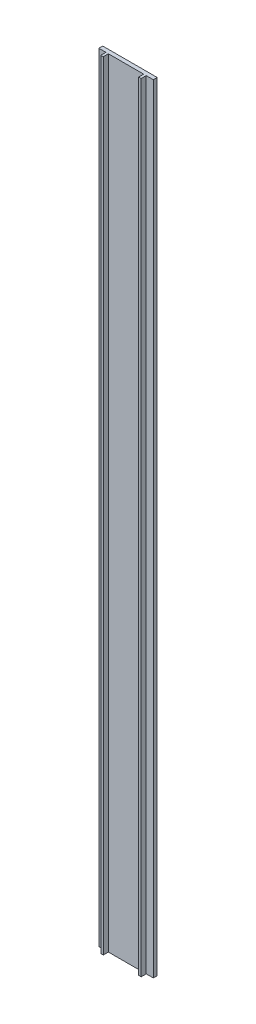
ISO-10303-21;
HEADER;
FILE_DESCRIPTION(('STEP AP214'),'2;1');
FILE_NAME('part.step','',(''),(''),'','','');
FILE_SCHEMA(('AUTOMOTIVE_DESIGN { 1 0 10303 214 1 1 1 1 }'));
ENDSEC;
DATA;
#1=APPLICATION_CONTEXT('core data for automotive mechanical design processes');
#2=APPLICATION_PROTOCOL_DEFINITION('international standard','automotive_design',2000,#1);
#3=PRODUCT_CONTEXT('',#1,'mechanical');
#4=PRODUCT('Part','Part','',(#3));
#5=PRODUCT_RELATED_PRODUCT_CATEGORY('part','',(#4));
#6=PRODUCT_DEFINITION_FORMATION('','',#4);
#7=PRODUCT_DEFINITION_CONTEXT('part definition',#1,'design');
#8=PRODUCT_DEFINITION('design','',#6,#7);
#9=PRODUCT_DEFINITION_SHAPE('','',#8);
#10=(LENGTH_UNIT() NAMED_UNIT(*) SI_UNIT(.MILLI.,.METRE.));
#11=(NAMED_UNIT(*) PLANE_ANGLE_UNIT() SI_UNIT($,.RADIAN.));
#12=(NAMED_UNIT(*) SI_UNIT($,.STERADIAN.) SOLID_ANGLE_UNIT());
#13=UNCERTAINTY_MEASURE_WITH_UNIT(LENGTH_MEASURE(1.E-05),#10,'distance_accuracy_value','');
#14=(GEOMETRIC_REPRESENTATION_CONTEXT(3) GLOBAL_UNCERTAINTY_ASSIGNED_CONTEXT((#13)) GLOBAL_UNIT_ASSIGNED_CONTEXT((#10,
#11,#12)) REPRESENTATION_CONTEXT('',''));
#15=CARTESIAN_POINT('',(0.,0.,0.));
#16=DIRECTION('',(0.,0.,1.));
#17=DIRECTION('',(1.,0.,0.));
#18=AXIS2_PLACEMENT_3D('',#15,#16,#17);
#19=CARTESIAN_POINT('',(0.,0.,5.));
#20=DIRECTION('',(0.,0.,-1.));
#21=DIRECTION('',(-1.,0.,0.));
#22=AXIS2_PLACEMENT_3D('',#19,#20,#21);
#23=PLANE('',#22);
#24=DIRECTION('',(0.,1.,0.));
#25=VECTOR('',#24,1.);
#26=CARTESIAN_POINT('',(25.905,500.,5.));
#27=LINE('',#26,#25);
#28=CARTESIAN_POINT('',(25.9050000000001,-500.,5.));
#29=VERTEX_POINT('',#28);
#30=CARTESIAN_POINT('',(25.9050000000001,500.,5.));
#31=VERTEX_POINT('',#30);
#32=EDGE_CURVE('E158',#29,#31,#27,.T.);
#33=ORIENTED_EDGE('',*,*,#32,.F.);
#34=DIRECTION('',(1.,0.,0.));
#35=VECTOR('',#34,1.);
#36=CARTESIAN_POINT('',(-35.,-500.,5.));
#37=LINE('',#36,#35);
#38=CARTESIAN_POINT('',(35.0000000000001,-500.,5.));
#39=VERTEX_POINT('',#38);
#40=EDGE_CURVE('E208',#29,#39,#37,.T.);
#41=ORIENTED_EDGE('',*,*,#40,.T.);
#42=DIRECTION('',(0.,1.,0.));
#43=VECTOR('',#42,1.);
#44=CARTESIAN_POINT('',(35.0000000000001,-500.,5.));
#45=LINE('',#44,#43);
#46=CARTESIAN_POINT('',(35.0000000000001,500.,5.));
#47=VERTEX_POINT('',#46);
#48=EDGE_CURVE('E199',#39,#47,#45,.T.);
#49=ORIENTED_EDGE('',*,*,#48,.T.);
#50=DIRECTION('',(-1.,0.,0.));
#51=VECTOR('',#50,1.);
#52=CARTESIAN_POINT('',(-35.,500.,5.));
#53=LINE('',#52,#51);
#54=EDGE_CURVE('E64',#47,#31,#53,.T.);
#55=ORIENTED_EDGE('',*,*,#54,.T.);
#56=EDGE_LOOP('',(#33,#41,#49,#55));
#57=FACE_BOUND('',#56,.T.);
#58=ADVANCED_FACE('F41',(#57),#23,.F.);
#59=DIRECTION('',(0.,-1.,0.));
#60=VECTOR('',#59,1.);
#61=CARTESIAN_POINT('',(22.695,500.,5.));
#62=LINE('',#61,#60);
#63=CARTESIAN_POINT('',(22.695,500.,5.));
#64=VERTEX_POINT('',#63);
#65=CARTESIAN_POINT('',(22.695,-500.,5.));
#66=VERTEX_POINT('',#65);
#67=EDGE_CURVE('E56',#64,#66,#62,.T.);
#68=ORIENTED_EDGE('',*,*,#67,.F.);
#69=CARTESIAN_POINT('',(-22.695,500.,5.));
#70=VERTEX_POINT('',#69);
#71=EDGE_CURVE('E206',#64,#70,#53,.T.);
#72=ORIENTED_EDGE('',*,*,#71,.T.);
#73=DIRECTION('',(0.,1.,0.));
#74=VECTOR('',#73,1.);
#75=CARTESIAN_POINT('',(-22.695,-500.,5.));
#76=LINE('',#75,#74);
#77=CARTESIAN_POINT('',(-22.695,-500.,5.));
#78=VERTEX_POINT('',#77);
#79=EDGE_CURVE('E159',#78,#70,#76,.T.);
#80=ORIENTED_EDGE('',*,*,#79,.F.);
#81=EDGE_CURVE('E213',#78,#66,#37,.T.);
#82=ORIENTED_EDGE('',*,*,#81,.T.);
#83=EDGE_LOOP('',(#68,#72,#80,#82));
#84=FACE_BOUND('',#83,.T.);
#85=ADVANCED_FACE('F250',(#84),#23,.F.);
#86=DIRECTION('',(0.,-1.,0.));
#87=VECTOR('',#86,1.);
#88=CARTESIAN_POINT('',(-25.905,-500.,5.));
#89=LINE('',#88,#87);
#90=CARTESIAN_POINT('',(-25.905,500.,5.));
#91=VERTEX_POINT('',#90);
#92=CARTESIAN_POINT('',(-25.905,-500.,5.));
#93=VERTEX_POINT('',#92);
#94=EDGE_CURVE('E163',#91,#93,#89,.T.);
#95=ORIENTED_EDGE('',*,*,#94,.F.);
#96=CARTESIAN_POINT('',(-35.,500.,5.));
#97=VERTEX_POINT('',#96);
#98=EDGE_CURVE('E202',#91,#97,#53,.T.);
#99=ORIENTED_EDGE('',*,*,#98,.T.);
#100=DIRECTION('',(0.,-1.,0.));
#101=VECTOR('',#100,1.);
#102=CARTESIAN_POINT('',(-35.,-500.,5.));
#103=LINE('',#102,#101);
#104=CARTESIAN_POINT('',(-35.,-500.,5.));
#105=VERTEX_POINT('',#104);
#106=EDGE_CURVE('E205',#97,#105,#103,.T.);
#107=ORIENTED_EDGE('',*,*,#106,.T.);
#108=EDGE_CURVE('E209',#105,#93,#37,.T.);
#109=ORIENTED_EDGE('',*,*,#108,.T.);
#110=EDGE_LOOP('',(#95,#99,#107,#109));
#111=FACE_BOUND('',#110,.T.);
#112=ADVANCED_FACE('F276',(#111),#23,.F.);
#113=CARTESIAN_POINT('',(35.0000000000001,-500.,5.));
#114=DIRECTION('',(-1.,0.,0.));
#115=DIRECTION('',(0.,0.,1.));
#116=AXIS2_PLACEMENT_3D('',#113,#114,#115);
#117=PLANE('',#116);
#118=DIRECTION('',(0.,1.,0.));
#119=VECTOR('',#118,1.);
#120=CARTESIAN_POINT('',(35.0000000000001,-500.,0.));
#121=LINE('',#120,#119);
#122=CARTESIAN_POINT('',(35.0000000000001,-500.,0.));
#123=VERTEX_POINT('',#122);
#124=CARTESIAN_POINT('',(35.0000000000001,500.,0.));
#125=VERTEX_POINT('',#124);
#126=EDGE_CURVE('E198',#123,#125,#121,.T.);
#127=ORIENTED_EDGE('',*,*,#126,.T.);
#128=DIRECTION('',(0.,0.,-1.));
#129=VECTOR('',#128,1.);
#130=CARTESIAN_POINT('',(35.0000000000001,500.,5.));
#131=LINE('',#130,#129);
#132=EDGE_CURVE('E11',#47,#125,#131,.T.);
#133=ORIENTED_EDGE('',*,*,#132,.F.);
#134=ORIENTED_EDGE('',*,*,#48,.F.);
#135=DIRECTION('',(0.,0.,-1.));
#136=VECTOR('',#135,1.);
#137=CARTESIAN_POINT('',(35.0000000000001,-500.,5.));
#138=LINE('',#137,#136);
#139=EDGE_CURVE('E212',#39,#123,#138,.T.);
#140=ORIENTED_EDGE('',*,*,#139,.T.);
#141=EDGE_LOOP('',(#127,#133,#134,#140));
#142=FACE_BOUND('',#141,.T.);
#143=ADVANCED_FACE('F43',(#142),#117,.F.);
#144=CARTESIAN_POINT('',(-35.,500.,5.));
#145=DIRECTION('',(0.,-1.,0.));
#146=DIRECTION('',(0.,0.,-1.));
#147=AXIS2_PLACEMENT_3D('',#144,#145,#146);
#148=PLANE('',#147);
#149=DIRECTION('',(-1.,0.,0.));
#150=VECTOR('',#149,1.);
#151=CARTESIAN_POINT('',(-35.,500.,0.));
#152=LINE('',#151,#150);
#153=CARTESIAN_POINT('',(-35.,500.,0.));
#154=VERTEX_POINT('',#153);
#155=EDGE_CURVE('E217',#125,#154,#152,.T.);
#156=ORIENTED_EDGE('',*,*,#155,.T.);
#157=DIRECTION('',(0.,0.,-1.));
#158=VECTOR('',#157,1.);
#159=CARTESIAN_POINT('',(-35.,500.,5.));
#160=LINE('',#159,#158);
#161=EDGE_CURVE('E49',#97,#154,#160,.T.);
#162=ORIENTED_EDGE('',*,*,#161,.F.);
#163=ORIENTED_EDGE('',*,*,#98,.F.);
#164=DIRECTION('',(0.,0.,-1.));
#165=VECTOR('',#164,1.);
#166=CARTESIAN_POINT('',(-25.905,500.,11.5));
#167=LINE('',#166,#165);
#168=CARTESIAN_POINT('',(-25.905,500.,11.5));
#169=VERTEX_POINT('',#168);
#170=EDGE_CURVE('E192',#169,#91,#167,.T.);
#171=ORIENTED_EDGE('',*,*,#170,.F.);
#172=DIRECTION('',(-1.,0.,0.));
#173=VECTOR('',#172,1.);
#174=CARTESIAN_POINT('',(-22.695,500.,11.5));
#175=LINE('',#174,#173);
#176=CARTESIAN_POINT('',(-22.695,500.,11.5));
#177=VERTEX_POINT('',#176);
#178=EDGE_CURVE('E173',#177,#169,#175,.T.);
#179=ORIENTED_EDGE('',*,*,#178,.F.);
#180=DIRECTION('',(0.,0.,-1.));
#181=VECTOR('',#180,1.);
#182=CARTESIAN_POINT('',(-22.695,500.,11.5));
#183=LINE('',#182,#181);
#184=EDGE_CURVE('E195',#177,#70,#183,.T.);
#185=ORIENTED_EDGE('',*,*,#184,.T.);
#186=ORIENTED_EDGE('',*,*,#71,.F.);
#187=DIRECTION('',(0.,0.,-1.));
#188=VECTOR('',#187,1.);
#189=CARTESIAN_POINT('',(22.695,500.,11.5));
#190=LINE('',#189,#188);
#191=CARTESIAN_POINT('',(22.695,500.,11.5));
#192=VERTEX_POINT('',#191);
#193=EDGE_CURVE('E142',#192,#64,#190,.T.);
#194=ORIENTED_EDGE('',*,*,#193,.F.);
#195=DIRECTION('',(-1.,0.,0.));
#196=VECTOR('',#195,1.);
#197=CARTESIAN_POINT('',(25.905,500.,11.5));
#198=LINE('',#197,#196);
#199=CARTESIAN_POINT('',(25.905,500.,11.5));
#200=VERTEX_POINT('',#199);
#201=EDGE_CURVE('E135',#200,#192,#198,.T.);
#202=ORIENTED_EDGE('',*,*,#201,.F.);
#203=DIRECTION('',(0.,0.,-1.));
#204=VECTOR('',#203,1.);
#205=CARTESIAN_POINT('',(25.905,500.,11.5));
#206=LINE('',#205,#204);
#207=EDGE_CURVE('E139',#200,#31,#206,.T.);
#208=ORIENTED_EDGE('',*,*,#207,.T.);
#209=ORIENTED_EDGE('',*,*,#54,.F.);
#210=ORIENTED_EDGE('',*,*,#132,.T.);
#211=EDGE_LOOP('',(#156,#162,#163,#171,#179,#185,#186,#194,#202,#208,#209,#210));
#212=FACE_BOUND('',#211,.T.);
#213=ADVANCED_FACE('F137',(#212),#148,.F.);
#214=CARTESIAN_POINT('',(-35.,-500.,5.));
#215=DIRECTION('',(1.,0.,0.));
#216=DIRECTION('',(0.,0.,-1.));
#217=AXIS2_PLACEMENT_3D('',#214,#215,#216);
#218=PLANE('',#217);
#219=DIRECTION('',(0.,-1.,0.));
#220=VECTOR('',#219,1.);
#221=CARTESIAN_POINT('',(-35.,-500.,0.));
#222=LINE('',#221,#220);
#223=CARTESIAN_POINT('',(-35.,-500.,0.));
#224=VERTEX_POINT('',#223);
#225=EDGE_CURVE('E219',#154,#224,#222,.T.);
#226=ORIENTED_EDGE('',*,*,#225,.T.);
#227=DIRECTION('',(0.,0.,-1.));
#228=VECTOR('',#227,1.);
#229=CARTESIAN_POINT('',(-35.,-500.,5.));
#230=LINE('',#229,#228);
#231=EDGE_CURVE('E226',#105,#224,#230,.T.);
#232=ORIENTED_EDGE('',*,*,#231,.F.);
#233=ORIENTED_EDGE('',*,*,#106,.F.);
#234=ORIENTED_EDGE('',*,*,#161,.T.);
#235=EDGE_LOOP('',(#226,#232,#233,#234));
#236=FACE_BOUND('',#235,.T.);
#237=ADVANCED_FACE('F233',(#236),#218,.F.);
#238=CARTESIAN_POINT('',(-35.,-500.,5.));
#239=DIRECTION('',(0.,1.,0.));
#240=DIRECTION('',(0.,0.,1.));
#241=AXIS2_PLACEMENT_3D('',#238,#239,#240);
#242=PLANE('',#241);
#243=DIRECTION('',(1.,0.,0.));
#244=VECTOR('',#243,1.);
#245=CARTESIAN_POINT('',(-35.,-500.,0.));
#246=LINE('',#245,#244);
#247=EDGE_CURVE('E203',#224,#123,#246,.T.);
#248=ORIENTED_EDGE('',*,*,#247,.T.);
#249=ORIENTED_EDGE('',*,*,#139,.F.);
#250=ORIENTED_EDGE('',*,*,#40,.F.);
#251=DIRECTION('',(0.,0.,-1.));
#252=VECTOR('',#251,1.);
#253=CARTESIAN_POINT('',(25.9050000000001,-500.,11.5));
#254=LINE('',#253,#252);
#255=CARTESIAN_POINT('',(25.9050000000001,-500.,11.5));
#256=VERTEX_POINT('',#255);
#257=EDGE_CURVE('E258',#256,#29,#254,.T.);
#258=ORIENTED_EDGE('',*,*,#257,.F.);
#259=DIRECTION('',(1.,0.,0.));
#260=VECTOR('',#259,1.);
#261=CARTESIAN_POINT('',(25.9050000000001,-500.,11.5));
#262=LINE('',#261,#260);
#263=CARTESIAN_POINT('',(22.6950000000001,-500.,11.5));
#264=VERTEX_POINT('',#263);
#265=EDGE_CURVE('E151',#264,#256,#262,.T.);
#266=ORIENTED_EDGE('',*,*,#265,.F.);
#267=DIRECTION('',(0.,0.,-1.));
#268=VECTOR('',#267,1.);
#269=CARTESIAN_POINT('',(22.6950000000001,-500.,11.5));
#270=LINE('',#269,#268);
#271=EDGE_CURVE('E165',#264,#66,#270,.T.);
#272=ORIENTED_EDGE('',*,*,#271,.T.);
#273=ORIENTED_EDGE('',*,*,#81,.F.);
#274=DIRECTION('',(0.,0.,-1.));
#275=VECTOR('',#274,1.);
#276=CARTESIAN_POINT('',(-22.695,-500.,11.5));
#277=LINE('',#276,#275);
#278=CARTESIAN_POINT('',(-22.695,-500.,11.5));
#279=VERTEX_POINT('',#278);
#280=EDGE_CURVE('E180',#279,#78,#277,.T.);
#281=ORIENTED_EDGE('',*,*,#280,.F.);
#282=DIRECTION('',(1.,0.,0.));
#283=VECTOR('',#282,1.);
#284=CARTESIAN_POINT('',(-22.695,-500.,11.5));
#285=LINE('',#284,#283);
#286=CARTESIAN_POINT('',(-25.905,-500.,11.5));
#287=VERTEX_POINT('',#286);
#288=EDGE_CURVE('E178',#287,#279,#285,.T.);
#289=ORIENTED_EDGE('',*,*,#288,.F.);
#290=DIRECTION('',(0.,0.,-1.));
#291=VECTOR('',#290,1.);
#292=CARTESIAN_POINT('',(-25.905,-500.,11.5));
#293=LINE('',#292,#291);
#294=EDGE_CURVE('E188',#287,#93,#293,.T.);
#295=ORIENTED_EDGE('',*,*,#294,.T.);
#296=ORIENTED_EDGE('',*,*,#108,.F.);
#297=ORIENTED_EDGE('',*,*,#231,.T.);
#298=EDGE_LOOP('',(#248,#249,#250,#258,#266,#272,#273,#281,#289,#295,#296,#297));
#299=FACE_BOUND('',#298,.T.);
#300=ADVANCED_FACE('F242',(#299),#242,.F.);
#301=CARTESIAN_POINT('',(0.,0.,0.));
#302=DIRECTION('',(0.,0.,-1.));
#303=DIRECTION('',(-1.,0.,0.));
#304=AXIS2_PLACEMENT_3D('',#301,#302,#303);
#305=PLANE('',#304);
#306=ORIENTED_EDGE('',*,*,#126,.F.);
#307=ORIENTED_EDGE('',*,*,#247,.F.);
#308=ORIENTED_EDGE('',*,*,#225,.F.);
#309=ORIENTED_EDGE('',*,*,#155,.F.);
#310=EDGE_LOOP('',(#306,#307,#308,#309));
#311=FACE_BOUND('',#310,.T.);
#312=ADVANCED_FACE('F239',(#311),#305,.T.);
#313=CARTESIAN_POINT('',(-22.695,-500.,11.5));
#314=DIRECTION('',(-1.,0.,0.));
#315=DIRECTION('',(0.,0.,1.));
#316=AXIS2_PLACEMENT_3D('',#313,#314,#315);
#317=PLANE('',#316);
#318=ORIENTED_EDGE('',*,*,#79,.T.);
#319=ORIENTED_EDGE('',*,*,#184,.F.);
#320=DIRECTION('',(0.,1.,0.));
#321=VECTOR('',#320,1.);
#322=CARTESIAN_POINT('',(-22.695,-500.,11.5));
#323=LINE('',#322,#321);
#324=EDGE_CURVE('E169',#279,#177,#323,.T.);
#325=ORIENTED_EDGE('',*,*,#324,.F.);
#326=ORIENTED_EDGE('',*,*,#280,.T.);
#327=EDGE_LOOP('',(#318,#319,#325,#326));
#328=FACE_BOUND('',#327,.T.);
#329=ADVANCED_FACE('F297',(#328),#317,.F.);
#330=CARTESIAN_POINT('',(-25.905,-500.,11.5));
#331=DIRECTION('',(1.,0.,0.));
#332=DIRECTION('',(0.,0.,-1.));
#333=AXIS2_PLACEMENT_3D('',#330,#331,#332);
#334=PLANE('',#333);
#335=ORIENTED_EDGE('',*,*,#94,.T.);
#336=ORIENTED_EDGE('',*,*,#294,.F.);
#337=DIRECTION('',(0.,-1.,0.));
#338=VECTOR('',#337,1.);
#339=CARTESIAN_POINT('',(-25.905,-500.,11.5));
#340=LINE('',#339,#338);
#341=EDGE_CURVE('E175',#169,#287,#340,.T.);
#342=ORIENTED_EDGE('',*,*,#341,.F.);
#343=ORIENTED_EDGE('',*,*,#170,.T.);
#344=EDGE_LOOP('',(#335,#336,#342,#343));
#345=FACE_BOUND('',#344,.T.);
#346=ADVANCED_FACE('F291',(#345),#334,.F.);
#347=CARTESIAN_POINT('',(0.,0.,11.5));
#348=DIRECTION('',(0.,0.,1.));
#349=DIRECTION('',(1.,0.,0.));
#350=AXIS2_PLACEMENT_3D('',#347,#348,#349);
#351=PLANE('',#350);
#352=ORIENTED_EDGE('',*,*,#324,.T.);
#353=ORIENTED_EDGE('',*,*,#178,.T.);
#354=ORIENTED_EDGE('',*,*,#341,.T.);
#355=ORIENTED_EDGE('',*,*,#288,.T.);
#356=EDGE_LOOP('',(#352,#353,#354,#355));
#357=FACE_BOUND('',#356,.T.);
#358=ADVANCED_FACE('F272',(#357),#351,.T.);
#359=CARTESIAN_POINT('',(25.905,500.,11.5));
#360=DIRECTION('',(-1.,0.,0.));
#361=DIRECTION('',(0.,-1.,0.));
#362=AXIS2_PLACEMENT_3D('',#359,#360,#361);
#363=PLANE('',#362);
#364=ORIENTED_EDGE('',*,*,#32,.T.);
#365=ORIENTED_EDGE('',*,*,#207,.F.);
#366=DIRECTION('',(0.,1.,0.));
#367=VECTOR('',#366,1.);
#368=CARTESIAN_POINT('',(25.905,500.,11.5));
#369=LINE('',#368,#367);
#370=EDGE_CURVE('E146',#256,#200,#369,.T.);
#371=ORIENTED_EDGE('',*,*,#370,.F.);
#372=ORIENTED_EDGE('',*,*,#257,.T.);
#373=EDGE_LOOP('',(#364,#365,#371,#372));
#374=FACE_BOUND('',#373,.T.);
#375=ADVANCED_FACE('F157',(#374),#363,.F.);
#376=CARTESIAN_POINT('',(22.695,500.,11.5));
#377=DIRECTION('',(1.,0.,0.));
#378=DIRECTION('',(0.,1.,0.));
#379=AXIS2_PLACEMENT_3D('',#376,#377,#378);
#380=PLANE('',#379);
#381=ORIENTED_EDGE('',*,*,#67,.T.);
#382=ORIENTED_EDGE('',*,*,#271,.F.);
#383=DIRECTION('',(0.,-1.,0.));
#384=VECTOR('',#383,1.);
#385=CARTESIAN_POINT('',(22.695,500.,11.5));
#386=LINE('',#385,#384);
#387=EDGE_CURVE('E145',#192,#264,#386,.T.);
#388=ORIENTED_EDGE('',*,*,#387,.F.);
#389=ORIENTED_EDGE('',*,*,#193,.T.);
#390=EDGE_LOOP('',(#381,#382,#388,#389));
#391=FACE_BOUND('',#390,.T.);
#392=ADVANCED_FACE('F255',(#391),#380,.F.);
#393=CARTESIAN_POINT('',(0.,0.,11.5));
#394=DIRECTION('',(0.,0.,-1.));
#395=DIRECTION('',(-1.,0.,0.));
#396=AXIS2_PLACEMENT_3D('',#393,#394,#395);
#397=PLANE('',#396);
#398=ORIENTED_EDGE('',*,*,#370,.T.);
#399=ORIENTED_EDGE('',*,*,#201,.T.);
#400=ORIENTED_EDGE('',*,*,#387,.T.);
#401=ORIENTED_EDGE('',*,*,#265,.T.);
#402=EDGE_LOOP('',(#398,#399,#400,#401));
#403=FACE_BOUND('',#402,.T.);
#404=ADVANCED_FACE('F149',(#403),#397,.F.);
#405=CLOSED_SHELL('',(#58,#85,#112,#143,#213,#237,#300,#312,#329,#346,#358,#375,#392,#404));
#406=MANIFOLD_SOLID_BREP('B2',#405);
#407=ADVANCED_BREP_SHAPE_REPRESENTATION('',(#18,#406),#14);
#408=SHAPE_DEFINITION_REPRESENTATION(#9,#407);
ENDSEC;
END-ISO-10303-21;
